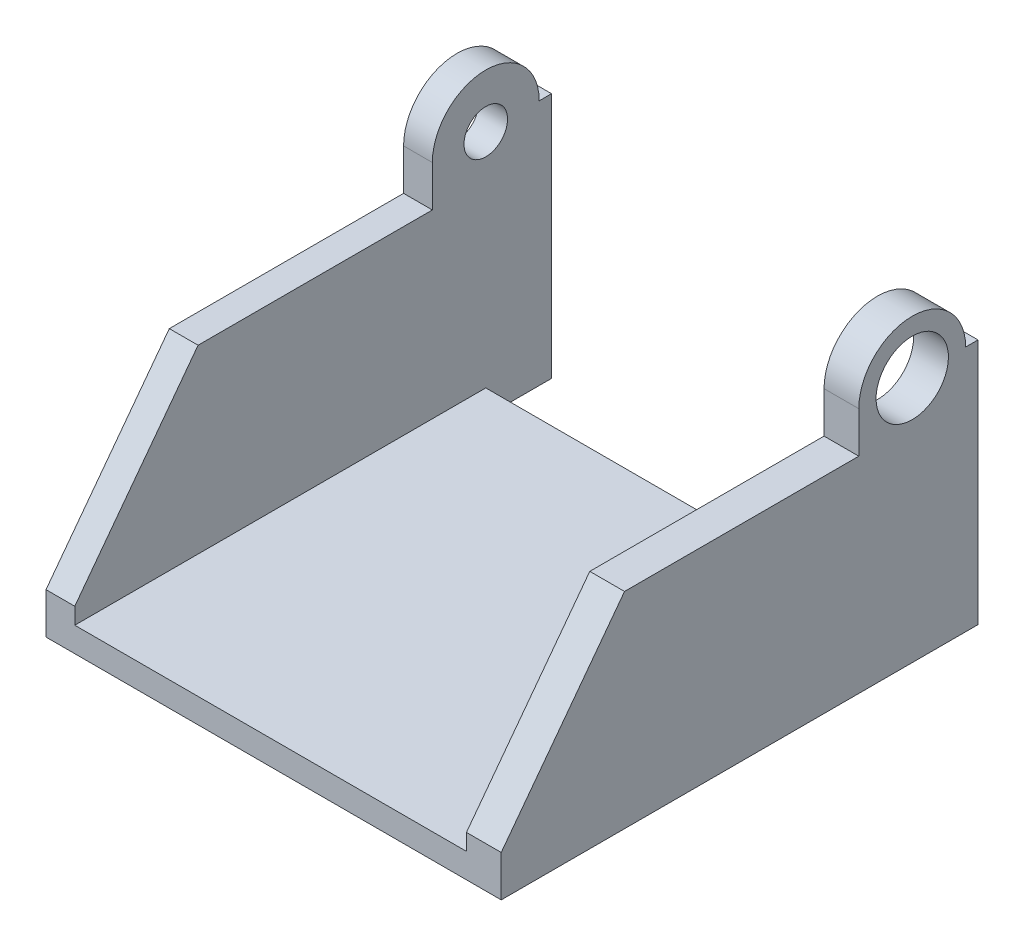
ISO-10303-21;
HEADER;
FILE_DESCRIPTION(('STEP AP214'),'2;1');
FILE_NAME('part.step','',(''),(''),'','','');
FILE_SCHEMA(('AUTOMOTIVE_DESIGN { 1 0 10303 214 1 1 1 1 }'));
ENDSEC;
DATA;
#1=APPLICATION_CONTEXT('core data for automotive mechanical design processes');
#2=APPLICATION_PROTOCOL_DEFINITION('international standard','automotive_design',2000,#1);
#3=PRODUCT_CONTEXT('',#1,'mechanical');
#4=PRODUCT('Part','Part','',(#3));
#5=PRODUCT_RELATED_PRODUCT_CATEGORY('part','',(#4));
#6=PRODUCT_DEFINITION_FORMATION('','',#4);
#7=PRODUCT_DEFINITION_CONTEXT('part definition',#1,'design');
#8=PRODUCT_DEFINITION('design','',#6,#7);
#9=PRODUCT_DEFINITION_SHAPE('','',#8);
#10=(LENGTH_UNIT() NAMED_UNIT(*) SI_UNIT(.MILLI.,.METRE.));
#11=(NAMED_UNIT(*) PLANE_ANGLE_UNIT() SI_UNIT($,.RADIAN.));
#12=(NAMED_UNIT(*) SI_UNIT($,.STERADIAN.) SOLID_ANGLE_UNIT());
#13=UNCERTAINTY_MEASURE_WITH_UNIT(LENGTH_MEASURE(1.E-05),#10,'distance_accuracy_value','');
#14=(GEOMETRIC_REPRESENTATION_CONTEXT(3) GLOBAL_UNCERTAINTY_ASSIGNED_CONTEXT((#13)) GLOBAL_UNIT_ASSIGNED_CONTEXT((#10,
#11,#12)) REPRESENTATION_CONTEXT('',''));
#15=CARTESIAN_POINT('',(0.,0.,0.));
#16=DIRECTION('',(0.,0.,1.));
#17=DIRECTION('',(1.,0.,0.));
#18=AXIS2_PLACEMENT_3D('',#15,#16,#17);
#19=CARTESIAN_POINT('',(0.,0.,50.));
#20=DIRECTION('',(0.,0.,1.));
#21=DIRECTION('',(1.,0.,0.));
#22=AXIS2_PLACEMENT_3D('',#19,#20,#21);
#23=PLANE('',#22);
#24=DIRECTION('',(-1.,0.,0.));
#25=VECTOR('',#24,1.);
#26=CARTESIAN_POINT('',(0.,-30.,50.));
#27=LINE('',#26,#25);
#28=CARTESIAN_POINT('',(28.055,-30.,50.));
#29=VERTEX_POINT('',#28);
#30=CARTESIAN_POINT('',(-27.325,-30.,50.));
#31=VERTEX_POINT('',#30);
#32=EDGE_CURVE('E347',#29,#31,#27,.T.);
#33=ORIENTED_EDGE('',*,*,#32,.F.);
#34=DIRECTION('',(0.,-1.,0.));
#35=VECTOR('',#34,1.);
#36=CARTESIAN_POINT('',(28.055,-25.,50.));
#37=LINE('',#36,#35);
#38=CARTESIAN_POINT('',(28.055,-25.,50.));
#39=VERTEX_POINT('',#38);
#40=EDGE_CURVE('E226',#39,#29,#37,.T.);
#41=ORIENTED_EDGE('',*,*,#40,.F.);
#42=DIRECTION('',(-1.,0.,0.));
#43=VECTOR('',#42,1.);
#44=CARTESIAN_POINT('',(0.,-25.,50.));
#45=LINE('',#44,#43);
#46=CARTESIAN_POINT('',(23.825,-25.,50.));
#47=VERTEX_POINT('',#46);
#48=EDGE_CURVE('E11',#39,#47,#45,.T.);
#49=ORIENTED_EDGE('',*,*,#48,.T.);
#50=DIRECTION('',(0.,-1.,0.));
#51=VECTOR('',#50,1.);
#52=CARTESIAN_POINT('',(23.825,0.,50.));
#53=LINE('',#52,#51);
#54=CARTESIAN_POINT('',(23.825,-27.,50.));
#55=VERTEX_POINT('',#54);
#56=EDGE_CURVE('E285',#47,#55,#53,.T.);
#57=ORIENTED_EDGE('',*,*,#56,.T.);
#58=DIRECTION('',(1.,0.,0.));
#59=VECTOR('',#58,1.);
#60=CARTESIAN_POINT('',(0.,-27.,50.));
#61=LINE('',#60,#59);
#62=CARTESIAN_POINT('',(-23.825,-27.,50.));
#63=VERTEX_POINT('',#62);
#64=EDGE_CURVE('E351',#63,#55,#61,.T.);
#65=ORIENTED_EDGE('',*,*,#64,.F.);
#66=DIRECTION('',(0.,-1.,0.));
#67=VECTOR('',#66,1.);
#68=CARTESIAN_POINT('',(-23.825,0.,50.));
#69=LINE('',#68,#67);
#70=CARTESIAN_POINT('',(-23.825,-25.,50.));
#71=VERTEX_POINT('',#70);
#72=EDGE_CURVE('E355',#71,#63,#69,.T.);
#73=ORIENTED_EDGE('',*,*,#72,.F.);
#74=DIRECTION('',(1.,0.,0.));
#75=VECTOR('',#74,1.);
#76=CARTESIAN_POINT('',(0.,-25.,50.));
#77=LINE('',#76,#75);
#78=CARTESIAN_POINT('',(-27.325,-25.,50.));
#79=VERTEX_POINT('',#78);
#80=EDGE_CURVE('E369',#79,#71,#77,.T.);
#81=ORIENTED_EDGE('',*,*,#80,.F.);
#82=DIRECTION('',(0.,-1.,0.));
#83=VECTOR('',#82,1.);
#84=CARTESIAN_POINT('',(-27.325,0.,50.));
#85=LINE('',#84,#83);
#86=EDGE_CURVE('E343',#79,#31,#85,.T.);
#87=ORIENTED_EDGE('',*,*,#86,.T.);
#88=EDGE_LOOP('',(#33,#41,#49,#57,#65,#73,#81,#87));
#89=FACE_BOUND('',#88,.T.);
#90=ADVANCED_FACE('F47',(#89),#23,.T.);
#91=CARTESIAN_POINT('',(0.,-30.,50.));
#92=DIRECTION('',(0.,-1.,0.));
#93=DIRECTION('',(0.,0.,-1.));
#94=AXIS2_PLACEMENT_3D('',#91,#92,#93);
#95=PLANE('',#94);
#96=DIRECTION('',(-1.,0.,0.));
#97=VECTOR('',#96,1.);
#98=CARTESIAN_POINT('',(27.325,-30.,-8.));
#99=LINE('',#98,#97);
#100=CARTESIAN_POINT('',(28.055,-30.,-8.));
#101=VERTEX_POINT('',#100);
#102=CARTESIAN_POINT('',(23.825,-30.,-8.));
#103=VERTEX_POINT('',#102);
#104=EDGE_CURVE('E185',#101,#103,#99,.T.);
#105=ORIENTED_EDGE('',*,*,#104,.F.);
#106=DIRECTION('',(0.,0.,-1.));
#107=VECTOR('',#106,1.);
#108=CARTESIAN_POINT('',(28.055,-30.,50.));
#109=LINE('',#108,#107);
#110=EDGE_CURVE('E203',#29,#101,#109,.T.);
#111=ORIENTED_EDGE('',*,*,#110,.F.);
#112=ORIENTED_EDGE('',*,*,#32,.T.);
#113=DIRECTION('',(0.,0.,-1.));
#114=VECTOR('',#113,1.);
#115=CARTESIAN_POINT('',(-27.325,-30.,50.));
#116=LINE('',#115,#114);
#117=CARTESIAN_POINT('',(-27.325,-30.,-8.));
#118=VERTEX_POINT('',#117);
#119=EDGE_CURVE('E366',#31,#118,#116,.T.);
#120=ORIENTED_EDGE('',*,*,#119,.T.);
#121=DIRECTION('',(1.,0.,0.));
#122=VECTOR('',#121,1.);
#123=CARTESIAN_POINT('',(-27.325,-30.,-8.));
#124=LINE('',#123,#122);
#125=CARTESIAN_POINT('',(-23.825,-30.,-8.));
#126=VERTEX_POINT('',#125);
#127=EDGE_CURVE('E335',#118,#126,#124,.T.);
#128=ORIENTED_EDGE('',*,*,#127,.T.);
#129=DIRECTION('',(0.,0.,-1.));
#130=VECTOR('',#129,1.);
#131=CARTESIAN_POINT('',(-23.825,-30.,0.));
#132=LINE('',#131,#130);
#133=CARTESIAN_POINT('',(-23.825,-30.,0.));
#134=VERTEX_POINT('',#133);
#135=EDGE_CURVE('E323',#134,#126,#132,.T.);
#136=ORIENTED_EDGE('',*,*,#135,.F.);
#137=DIRECTION('',(-1.,0.,0.));
#138=VECTOR('',#137,1.);
#139=CARTESIAN_POINT('',(0.,-30.,0.));
#140=LINE('',#139,#138);
#141=CARTESIAN_POINT('',(23.825,-30.,0.));
#142=VERTEX_POINT('',#141);
#143=EDGE_CURVE('E334',#142,#134,#140,.T.);
#144=ORIENTED_EDGE('',*,*,#143,.F.);
#145=DIRECTION('',(0.,0.,-1.));
#146=VECTOR('',#145,1.);
#147=CARTESIAN_POINT('',(23.825,-30.,0.));
#148=LINE('',#147,#146);
#149=EDGE_CURVE('E274',#142,#103,#148,.T.);
#150=ORIENTED_EDGE('',*,*,#149,.T.);
#151=EDGE_LOOP('',(#105,#111,#112,#120,#128,#136,#144,#150));
#152=FACE_BOUND('',#151,.T.);
#153=ADVANCED_FACE('F407',(#152),#95,.T.);
#154=CARTESIAN_POINT('',(27.325,0.,0.));
#155=DIRECTION('',(0.,1.,0.));
#156=DIRECTION('',(0.,0.,1.));
#157=AXIS2_PLACEMENT_3D('',#154,#155,#156);
#158=PLANE('',#157);
#159=DIRECTION('',(-1.,0.,0.));
#160=VECTOR('',#159,1.);
#161=CARTESIAN_POINT('',(27.325,0.,-6.5));
#162=LINE('',#161,#160);
#163=CARTESIAN_POINT('',(28.055,0.,-6.5));
#164=VERTEX_POINT('',#163);
#165=CARTESIAN_POINT('',(23.825,0.,-6.5));
#166=VERTEX_POINT('',#165);
#167=EDGE_CURVE('E191',#164,#166,#162,.T.);
#168=ORIENTED_EDGE('',*,*,#167,.F.);
#169=DIRECTION('',(0.,0.,1.));
#170=VECTOR('',#169,1.);
#171=CARTESIAN_POINT('',(28.055,0.,-8.));
#172=LINE('',#171,#170);
#173=CARTESIAN_POINT('',(28.055,0.,-8.));
#174=VERTEX_POINT('',#173);
#175=EDGE_CURVE('E189',#174,#164,#172,.T.);
#176=ORIENTED_EDGE('',*,*,#175,.F.);
#177=DIRECTION('',(-1.,0.,0.));
#178=VECTOR('',#177,1.);
#179=CARTESIAN_POINT('',(27.325,0.,-8.));
#180=LINE('',#179,#178);
#181=CARTESIAN_POINT('',(23.825,0.,-8.));
#182=VERTEX_POINT('',#181);
#183=EDGE_CURVE('E174',#174,#182,#180,.T.);
#184=ORIENTED_EDGE('',*,*,#183,.T.);
#185=DIRECTION('',(0.,0.,-1.));
#186=VECTOR('',#185,1.);
#187=CARTESIAN_POINT('',(23.825,0.,0.));
#188=LINE('',#187,#186);
#189=EDGE_CURVE('E269',#166,#182,#188,.T.);
#190=ORIENTED_EDGE('',*,*,#189,.F.);
#191=EDGE_LOOP('',(#168,#176,#184,#190));
#192=FACE_BOUND('',#191,.T.);
#193=ADVANCED_FACE('F190',(#192),#158,.T.);
#194=CARTESIAN_POINT('',(27.325,0.,0.));
#195=DIRECTION('',(-1.,0.,0.));
#196=DIRECTION('',(0.,-1.,0.));
#197=AXIS2_PLACEMENT_3D('',#194,#195,#196);
#198=CYLINDRICAL_SURFACE('',#197,6.5);
#199=DIRECTION('',(-1.,0.,0.));
#200=VECTOR('',#199,1.);
#201=CARTESIAN_POINT('',(27.325,0.,6.5));
#202=LINE('',#201,#200);
#203=CARTESIAN_POINT('',(28.055,0.,6.5));
#204=VERTEX_POINT('',#203);
#205=CARTESIAN_POINT('',(23.825,0.,6.5));
#206=VERTEX_POINT('',#205);
#207=EDGE_CURVE('E286',#204,#206,#202,.T.);
#208=ORIENTED_EDGE('',*,*,#207,.F.);
#209=CARTESIAN_POINT('',(28.055,0.,0.));
#210=DIRECTION('',(1.,0.,0.));
#211=DIRECTION('',(0.,1.,0.));
#212=AXIS2_PLACEMENT_3D('',#209,#210,#211);
#213=CIRCLE('',#212,6.5);
#214=EDGE_CURVE('E196',#164,#204,#213,.T.);
#215=ORIENTED_EDGE('',*,*,#214,.F.);
#216=ORIENTED_EDGE('',*,*,#167,.T.);
#217=CARTESIAN_POINT('',(23.825,0.,0.));
#218=DIRECTION('',(1.,0.,0.));
#219=DIRECTION('',(0.,1.,0.));
#220=AXIS2_PLACEMENT_3D('',#217,#218,#219);
#221=CIRCLE('',#220,6.5);
#222=EDGE_CURVE('E186',#166,#206,#221,.T.);
#223=ORIENTED_EDGE('',*,*,#222,.T.);
#224=EDGE_LOOP('',(#208,#215,#216,#223));
#225=FACE_BOUND('',#224,.T.);
#226=ADVANCED_FACE('F489',(#225),#198,.T.);
#227=CARTESIAN_POINT('',(27.325,0.,-8.));
#228=DIRECTION('',(0.,0.,-1.));
#229=DIRECTION('',(0.,1.,0.));
#230=AXIS2_PLACEMENT_3D('',#227,#228,#229);
#231=PLANE('',#230);
#232=ORIENTED_EDGE('',*,*,#183,.F.);
#233=DIRECTION('',(0.,1.,0.));
#234=VECTOR('',#233,1.);
#235=CARTESIAN_POINT('',(28.055,-30.,-8.));
#236=LINE('',#235,#234);
#237=EDGE_CURVE('E178',#101,#174,#236,.T.);
#238=ORIENTED_EDGE('',*,*,#237,.F.);
#239=ORIENTED_EDGE('',*,*,#104,.T.);
#240=DIRECTION('',(0.,-1.,0.));
#241=VECTOR('',#240,1.);
#242=CARTESIAN_POINT('',(23.825,0.,-8.));
#243=LINE('',#242,#241);
#244=EDGE_CURVE('E180',#182,#103,#243,.T.);
#245=ORIENTED_EDGE('',*,*,#244,.F.);
#246=EDGE_LOOP('',(#232,#238,#239,#245));
#247=FACE_BOUND('',#246,.T.);
#248=ADVANCED_FACE('F176',(#247),#231,.T.);
#249=CARTESIAN_POINT('',(20.175,-5.,0.));
#250=DIRECTION('',(0.,1.,0.));
#251=DIRECTION('',(-1.,0.,0.));
#252=AXIS2_PLACEMENT_3D('',#249,#250,#251);
#253=PLANE('',#252);
#254=DIRECTION('',(1.,0.,0.));
#255=VECTOR('',#254,1.);
#256=CARTESIAN_POINT('',(20.175,-5.,35.));
#257=LINE('',#256,#255);
#258=CARTESIAN_POINT('',(23.825,-5.,35.));
#259=VERTEX_POINT('',#258);
#260=CARTESIAN_POINT('',(28.055,-5.,35.));
#261=VERTEX_POINT('',#260);
#262=EDGE_CURVE('E231',#259,#261,#257,.T.);
#263=ORIENTED_EDGE('',*,*,#262,.T.);
#264=DIRECTION('',(0.,0.,1.));
#265=VECTOR('',#264,1.);
#266=CARTESIAN_POINT('',(28.055,-5.,6.5));
#267=LINE('',#266,#265);
#268=CARTESIAN_POINT('',(28.055,-5.,6.5));
#269=VERTEX_POINT('',#268);
#270=EDGE_CURVE('E218',#269,#261,#267,.T.);
#271=ORIENTED_EDGE('',*,*,#270,.F.);
#272=DIRECTION('',(1.,0.,0.));
#273=VECTOR('',#272,1.);
#274=CARTESIAN_POINT('',(20.175,-5.,6.5));
#275=LINE('',#274,#273);
#276=CARTESIAN_POINT('',(23.825,-5.,6.5));
#277=VERTEX_POINT('',#276);
#278=EDGE_CURVE('E232',#277,#269,#275,.T.);
#279=ORIENTED_EDGE('',*,*,#278,.F.);
#280=DIRECTION('',(0.,0.,1.));
#281=VECTOR('',#280,1.);
#282=CARTESIAN_POINT('',(23.825,-5.,50.));
#283=LINE('',#282,#281);
#284=EDGE_CURVE('E244',#277,#259,#283,.T.);
#285=ORIENTED_EDGE('',*,*,#284,.T.);
#286=EDGE_LOOP('',(#263,#271,#279,#285));
#287=FACE_BOUND('',#286,.T.);
#288=ADVANCED_FACE('F473',(#287),#253,.T.);
#289=CARTESIAN_POINT('',(20.175,15.,20.));
#290=DIRECTION('',(0.,0.6,0.8));
#291=DIRECTION('',(0.,-0.8,0.6));
#292=AXIS2_PLACEMENT_3D('',#289,#290,#291);
#293=PLANE('',#292);
#294=ORIENTED_EDGE('',*,*,#48,.F.);
#295=DIRECTION('',(0.,-0.8,0.6));
#296=VECTOR('',#295,1.);
#297=CARTESIAN_POINT('',(28.055,-5.,35.));
#298=LINE('',#297,#296);
#299=EDGE_CURVE('E222',#261,#39,#298,.T.);
#300=ORIENTED_EDGE('',*,*,#299,.F.);
#301=ORIENTED_EDGE('',*,*,#262,.F.);
#302=DIRECTION('',(0.,-0.8,0.6));
#303=VECTOR('',#302,1.);
#304=CARTESIAN_POINT('',(23.825,-9.00000000000001,38.));
#305=LINE('',#304,#303);
#306=EDGE_CURVE('E240',#259,#47,#305,.T.);
#307=ORIENTED_EDGE('',*,*,#306,.T.);
#308=EDGE_LOOP('',(#294,#300,#301,#307));
#309=FACE_BOUND('',#308,.T.);
#310=ADVANCED_FACE('F476',(#309),#293,.T.);
#311=CARTESIAN_POINT('',(20.175,0.,6.5));
#312=DIRECTION('',(0.,0.,1.));
#313=DIRECTION('',(0.,-1.,0.));
#314=AXIS2_PLACEMENT_3D('',#311,#312,#313);
#315=PLANE('',#314);
#316=ORIENTED_EDGE('',*,*,#278,.T.);
#317=DIRECTION('',(0.,-1.,0.));
#318=VECTOR('',#317,1.);
#319=CARTESIAN_POINT('',(28.055,0.,6.5));
#320=LINE('',#319,#318);
#321=EDGE_CURVE('E214',#204,#269,#320,.T.);
#322=ORIENTED_EDGE('',*,*,#321,.F.);
#323=ORIENTED_EDGE('',*,*,#207,.T.);
#324=DIRECTION('',(0.,-1.,0.));
#325=VECTOR('',#324,1.);
#326=CARTESIAN_POINT('',(23.825,0.,6.5));
#327=LINE('',#326,#325);
#328=EDGE_CURVE('E235',#206,#277,#327,.T.);
#329=ORIENTED_EDGE('',*,*,#328,.T.);
#330=EDGE_LOOP('',(#316,#322,#323,#329));
#331=FACE_BOUND('',#330,.T.);
#332=ADVANCED_FACE('F444',(#331),#315,.T.);
#333=CARTESIAN_POINT('',(23.825,0.,50.));
#334=DIRECTION('',(1.,0.,0.));
#335=DIRECTION('',(0.,1.,0.));
#336=AXIS2_PLACEMENT_3D('',#333,#334,#335);
#337=PLANE('',#336);
#338=CARTESIAN_POINT('',(23.825,0.,0.));
#339=DIRECTION('',(1.,0.,0.));
#340=DIRECTION('',(0.,1.,0.));
#341=AXIS2_PLACEMENT_3D('',#338,#339,#340);
#342=CIRCLE('',#341,4.4);
#343=CARTESIAN_POINT('',(23.825,4.4,0.));
#344=VERTEX_POINT('',#343);
#345=EDGE_CURVE('E452',#344,#344,#342,.T.);
#346=ORIENTED_EDGE('',*,*,#345,.T.);
#347=EDGE_LOOP('',(#346));
#348=FACE_BOUND('',#347,.T.);
#349=ORIENTED_EDGE('',*,*,#328,.F.);
#350=ORIENTED_EDGE('',*,*,#222,.F.);
#351=ORIENTED_EDGE('',*,*,#189,.T.);
#352=ORIENTED_EDGE('',*,*,#244,.T.);
#353=ORIENTED_EDGE('',*,*,#149,.F.);
#354=DIRECTION('',(0.,1.,0.));
#355=VECTOR('',#354,1.);
#356=CARTESIAN_POINT('',(23.825,0.,0.));
#357=LINE('',#356,#355);
#358=CARTESIAN_POINT('',(23.825,-27.,0.));
#359=VERTEX_POINT('',#358);
#360=EDGE_CURVE('E64',#142,#359,#357,.T.);
#361=ORIENTED_EDGE('',*,*,#360,.T.);
#362=DIRECTION('',(0.,0.,-1.));
#363=VECTOR('',#362,1.);
#364=CARTESIAN_POINT('',(23.825,-27.,50.));
#365=LINE('',#364,#363);
#366=EDGE_CURVE('E293',#55,#359,#365,.T.);
#367=ORIENTED_EDGE('',*,*,#366,.F.);
#368=ORIENTED_EDGE('',*,*,#56,.F.);
#369=ORIENTED_EDGE('',*,*,#306,.F.);
#370=ORIENTED_EDGE('',*,*,#284,.F.);
#371=EDGE_LOOP('',(#349,#350,#351,#352,#353,#361,#367,#368,#369,#370));
#372=FACE_BOUND('',#371,.T.);
#373=ADVANCED_FACE('F438',(#348,#372),#337,.F.);
#374=CARTESIAN_POINT('',(-27.325,0.,50.));
#375=DIRECTION('',(1.,0.,0.));
#376=DIRECTION('',(0.,1.,0.));
#377=AXIS2_PLACEMENT_3D('',#374,#375,#376);
#378=PLANE('',#377);
#379=CARTESIAN_POINT('',(-27.325,0.,0.));
#380=DIRECTION('',(-1.,0.,0.));
#381=DIRECTION('',(0.,-1.,0.));
#382=AXIS2_PLACEMENT_3D('',#379,#380,#381);
#383=CIRCLE('',#382,2.65);
#384=CARTESIAN_POINT('',(-27.325,-2.65,0.));
#385=VERTEX_POINT('',#384);
#386=EDGE_CURVE('E449',#385,#385,#383,.T.);
#387=ORIENTED_EDGE('',*,*,#386,.F.);
#388=EDGE_LOOP('',(#387));
#389=FACE_BOUND('',#388,.T.);
#390=DIRECTION('',(0.,0.,1.));
#391=VECTOR('',#390,1.);
#392=CARTESIAN_POINT('',(-27.325,-5.,0.));
#393=LINE('',#392,#391);
#394=CARTESIAN_POINT('',(-27.325,-5.,6.5));
#395=VERTEX_POINT('',#394);
#396=CARTESIAN_POINT('',(-27.325,-5.,35.));
#397=VERTEX_POINT('',#396);
#398=EDGE_CURVE('E251',#395,#397,#393,.T.);
#399=ORIENTED_EDGE('',*,*,#398,.F.);
#400=DIRECTION('',(0.,-1.,0.));
#401=VECTOR('',#400,1.);
#402=CARTESIAN_POINT('',(-27.325,0.,6.5));
#403=LINE('',#402,#401);
#404=CARTESIAN_POINT('',(-27.325,0.,6.5));
#405=VERTEX_POINT('',#404);
#406=EDGE_CURVE('E247',#405,#395,#403,.T.);
#407=ORIENTED_EDGE('',*,*,#406,.F.);
#408=CARTESIAN_POINT('',(-27.325,0.,0.));
#409=DIRECTION('',(1.,0.,0.));
#410=DIRECTION('',(0.,1.,0.));
#411=AXIS2_PLACEMENT_3D('',#408,#409,#410);
#412=CIRCLE('',#411,6.5);
#413=CARTESIAN_POINT('',(-27.325,0.,-6.5));
#414=VERTEX_POINT('',#413);
#415=EDGE_CURVE('E302',#414,#405,#412,.T.);
#416=ORIENTED_EDGE('',*,*,#415,.F.);
#417=DIRECTION('',(0.,0.,-1.));
#418=VECTOR('',#417,1.);
#419=CARTESIAN_POINT('',(-27.325,0.,0.));
#420=LINE('',#419,#418);
#421=CARTESIAN_POINT('',(-27.325,0.,-8.));
#422=VERTEX_POINT('',#421);
#423=EDGE_CURVE('E298',#414,#422,#420,.T.);
#424=ORIENTED_EDGE('',*,*,#423,.T.);
#425=DIRECTION('',(0.,-1.,0.));
#426=VECTOR('',#425,1.);
#427=CARTESIAN_POINT('',(-27.325,0.,-8.));
#428=LINE('',#427,#426);
#429=EDGE_CURVE('E307',#422,#118,#428,.T.);
#430=ORIENTED_EDGE('',*,*,#429,.T.);
#431=ORIENTED_EDGE('',*,*,#119,.F.);
#432=ORIENTED_EDGE('',*,*,#86,.F.);
#433=DIRECTION('',(0.,-0.8,0.6));
#434=VECTOR('',#433,1.);
#435=CARTESIAN_POINT('',(-27.325,15.,20.));
#436=LINE('',#435,#434);
#437=EDGE_CURVE('E255',#397,#79,#436,.T.);
#438=ORIENTED_EDGE('',*,*,#437,.F.);
#439=EDGE_LOOP('',(#399,#407,#416,#424,#430,#431,#432,#438));
#440=FACE_BOUND('',#439,.T.);
#441=ADVANCED_FACE('F49',(#389,#440),#378,.F.);
#442=CARTESIAN_POINT('',(0.,-27.,50.));
#443=DIRECTION('',(0.,1.,0.));
#444=DIRECTION('',(0.,0.,1.));
#445=AXIS2_PLACEMENT_3D('',#442,#443,#444);
#446=PLANE('',#445);
#447=DIRECTION('',(1.,0.,0.));
#448=VECTOR('',#447,1.);
#449=CARTESIAN_POINT('',(0.,-27.,0.));
#450=LINE('',#449,#448);
#451=CARTESIAN_POINT('',(-23.825,-27.,0.));
#452=VERTEX_POINT('',#451);
#453=EDGE_CURVE('E348',#452,#359,#450,.T.);
#454=ORIENTED_EDGE('',*,*,#453,.F.);
#455=DIRECTION('',(0.,0.,-1.));
#456=VECTOR('',#455,1.);
#457=CARTESIAN_POINT('',(-23.825,-27.,50.));
#458=LINE('',#457,#456);
#459=EDGE_CURVE('E358',#63,#452,#458,.T.);
#460=ORIENTED_EDGE('',*,*,#459,.F.);
#461=ORIENTED_EDGE('',*,*,#64,.T.);
#462=ORIENTED_EDGE('',*,*,#366,.T.);
#463=EDGE_LOOP('',(#454,#460,#461,#462));
#464=FACE_BOUND('',#463,.T.);
#465=ADVANCED_FACE('F402',(#464),#446,.T.);
#466=CARTESIAN_POINT('',(-23.825,0.,50.));
#467=DIRECTION('',(1.,0.,0.));
#468=DIRECTION('',(0.,1.,0.));
#469=AXIS2_PLACEMENT_3D('',#466,#467,#468);
#470=PLANE('',#469);
#471=CARTESIAN_POINT('',(-23.825,0.,0.));
#472=DIRECTION('',(1.,0.,0.));
#473=DIRECTION('',(0.,1.,0.));
#474=AXIS2_PLACEMENT_3D('',#471,#472,#473);
#475=CIRCLE('',#474,2.65);
#476=CARTESIAN_POINT('',(-23.825,2.65,0.));
#477=VERTEX_POINT('',#476);
#478=EDGE_CURVE('E51',#477,#477,#475,.T.);
#479=ORIENTED_EDGE('',*,*,#478,.F.);
#480=EDGE_LOOP('',(#479));
#481=FACE_BOUND('',#480,.T.);
#482=DIRECTION('',(0.,1.,0.));
#483=VECTOR('',#482,1.);
#484=CARTESIAN_POINT('',(-23.825,0.,6.5));
#485=LINE('',#484,#483);
#486=CARTESIAN_POINT('',(-23.825,-5.,6.5));
#487=VERTEX_POINT('',#486);
#488=CARTESIAN_POINT('',(-23.825,0.,6.5));
#489=VERTEX_POINT('',#488);
#490=EDGE_CURVE('E72',#487,#489,#485,.T.);
#491=ORIENTED_EDGE('',*,*,#490,.F.);
#492=DIRECTION('',(0.,0.,-1.));
#493=VECTOR('',#492,1.);
#494=CARTESIAN_POINT('',(-23.825,-5.,50.));
#495=LINE('',#494,#493);
#496=CARTESIAN_POINT('',(-23.825,-5.,35.));
#497=VERTEX_POINT('',#496);
#498=EDGE_CURVE('E57',#497,#487,#495,.T.);
#499=ORIENTED_EDGE('',*,*,#498,.F.);
#500=DIRECTION('',(0.,0.8,-0.6));
#501=VECTOR('',#500,1.);
#502=CARTESIAN_POINT('',(-23.825,-9.00000000000001,38.));
#503=LINE('',#502,#501);
#504=EDGE_CURVE('E266',#71,#497,#503,.T.);
#505=ORIENTED_EDGE('',*,*,#504,.F.);
#506=ORIENTED_EDGE('',*,*,#72,.T.);
#507=ORIENTED_EDGE('',*,*,#459,.T.);
#508=DIRECTION('',(0.,1.,0.));
#509=VECTOR('',#508,1.);
#510=CARTESIAN_POINT('',(-23.825,0.,0.));
#511=LINE('',#510,#509);
#512=EDGE_CURVE('E319',#134,#452,#511,.T.);
#513=ORIENTED_EDGE('',*,*,#512,.F.);
#514=ORIENTED_EDGE('',*,*,#135,.T.);
#515=DIRECTION('',(0.,-1.,0.));
#516=VECTOR('',#515,1.);
#517=CARTESIAN_POINT('',(-23.825,0.,-8.));
#518=LINE('',#517,#516);
#519=CARTESIAN_POINT('',(-23.825,0.,-8.));
#520=VERTEX_POINT('',#519);
#521=EDGE_CURVE('E303',#520,#126,#518,.T.);
#522=ORIENTED_EDGE('',*,*,#521,.F.);
#523=DIRECTION('',(0.,0.,-1.));
#524=VECTOR('',#523,1.);
#525=CARTESIAN_POINT('',(-23.825,0.,0.));
#526=LINE('',#525,#524);
#527=CARTESIAN_POINT('',(-23.825,0.,-6.5));
#528=VERTEX_POINT('',#527);
#529=EDGE_CURVE('E297',#528,#520,#526,.T.);
#530=ORIENTED_EDGE('',*,*,#529,.F.);
#531=CARTESIAN_POINT('',(-23.825,0.,0.));
#532=DIRECTION('',(1.,0.,0.));
#533=DIRECTION('',(0.,1.,0.));
#534=AXIS2_PLACEMENT_3D('',#531,#532,#533);
#535=CIRCLE('',#534,6.5);
#536=EDGE_CURVE('E315',#528,#489,#535,.T.);
#537=ORIENTED_EDGE('',*,*,#536,.T.);
#538=EDGE_LOOP('',(#491,#499,#505,#506,#507,#513,#514,#522,#530,#537));
#539=FACE_BOUND('',#538,.T.);
#540=ADVANCED_FACE('F382',(#481,#539),#470,.T.);
#541=CARTESIAN_POINT('',(0.,0.,0.));
#542=DIRECTION('',(0.,0.,1.));
#543=DIRECTION('',(1.,0.,0.));
#544=AXIS2_PLACEMENT_3D('',#541,#542,#543);
#545=PLANE('',#544);
#546=ORIENTED_EDGE('',*,*,#453,.T.);
#547=ORIENTED_EDGE('',*,*,#360,.F.);
#548=ORIENTED_EDGE('',*,*,#143,.T.);
#549=ORIENTED_EDGE('',*,*,#512,.T.);
#550=EDGE_LOOP('',(#546,#547,#548,#549));
#551=FACE_BOUND('',#550,.T.);
#552=ADVANCED_FACE('F404',(#551),#545,.F.);
#553=CARTESIAN_POINT('',(-27.325,0.,0.));
#554=DIRECTION('',(0.,-1.,0.));
#555=DIRECTION('',(0.,0.,-1.));
#556=AXIS2_PLACEMENT_3D('',#553,#554,#555);
#557=PLANE('',#556);
#558=ORIENTED_EDGE('',*,*,#529,.T.);
#559=DIRECTION('',(1.,0.,0.));
#560=VECTOR('',#559,1.);
#561=CARTESIAN_POINT('',(-27.325,0.,-8.));
#562=LINE('',#561,#560);
#563=EDGE_CURVE('E330',#422,#520,#562,.T.);
#564=ORIENTED_EDGE('',*,*,#563,.F.);
#565=ORIENTED_EDGE('',*,*,#423,.F.);
#566=DIRECTION('',(1.,0.,0.));
#567=VECTOR('',#566,1.);
#568=CARTESIAN_POINT('',(-27.325,0.,-6.5));
#569=LINE('',#568,#567);
#570=EDGE_CURVE('E311',#414,#528,#569,.T.);
#571=ORIENTED_EDGE('',*,*,#570,.T.);
#572=EDGE_LOOP('',(#558,#564,#565,#571));
#573=FACE_BOUND('',#572,.T.);
#574=ADVANCED_FACE('F414',(#573),#557,.F.);
#575=CARTESIAN_POINT('',(-27.325,0.,-8.));
#576=DIRECTION('',(0.,0.,1.));
#577=DIRECTION('',(0.,-1.,0.));
#578=AXIS2_PLACEMENT_3D('',#575,#576,#577);
#579=PLANE('',#578);
#580=ORIENTED_EDGE('',*,*,#521,.T.);
#581=ORIENTED_EDGE('',*,*,#127,.F.);
#582=ORIENTED_EDGE('',*,*,#429,.F.);
#583=ORIENTED_EDGE('',*,*,#563,.T.);
#584=EDGE_LOOP('',(#580,#581,#582,#583));
#585=FACE_BOUND('',#584,.T.);
#586=ADVANCED_FACE('F411',(#585),#579,.F.);
#587=CARTESIAN_POINT('',(-27.325,0.,0.));
#588=DIRECTION('',(1.,0.,0.));
#589=DIRECTION('',(0.,1.,0.));
#590=AXIS2_PLACEMENT_3D('',#587,#588,#589);
#591=CYLINDRICAL_SURFACE('',#590,6.5);
#592=ORIENTED_EDGE('',*,*,#536,.F.);
#593=ORIENTED_EDGE('',*,*,#570,.F.);
#594=ORIENTED_EDGE('',*,*,#415,.T.);
#595=DIRECTION('',(1.,0.,0.));
#596=VECTOR('',#595,1.);
#597=CARTESIAN_POINT('',(-27.325,0.,6.5));
#598=LINE('',#597,#596);
#599=EDGE_CURVE('E338',#405,#489,#598,.T.);
#600=ORIENTED_EDGE('',*,*,#599,.T.);
#601=EDGE_LOOP('',(#592,#593,#594,#600));
#602=FACE_BOUND('',#601,.T.);
#603=ADVANCED_FACE('F386',(#602),#591,.T.);
#604=CARTESIAN_POINT('',(-20.175,0.,6.5));
#605=DIRECTION('',(0.,0.,-1.));
#606=DIRECTION('',(0.,1.,0.));
#607=AXIS2_PLACEMENT_3D('',#604,#605,#606);
#608=PLANE('',#607);
#609=ORIENTED_EDGE('',*,*,#490,.T.);
#610=ORIENTED_EDGE('',*,*,#599,.F.);
#611=ORIENTED_EDGE('',*,*,#406,.T.);
#612=DIRECTION('',(-1.,0.,0.));
#613=VECTOR('',#612,1.);
#614=CARTESIAN_POINT('',(-20.175,-5.,6.5));
#615=LINE('',#614,#613);
#616=EDGE_CURVE('E258',#487,#395,#615,.T.);
#617=ORIENTED_EDGE('',*,*,#616,.F.);
#618=EDGE_LOOP('',(#609,#610,#611,#617));
#619=FACE_BOUND('',#618,.T.);
#620=ADVANCED_FACE('F379',(#619),#608,.F.);
#621=CARTESIAN_POINT('',(-20.175,15.,20.));
#622=DIRECTION('',(0.,-0.6,-0.8));
#623=DIRECTION('',(0.,0.8,-0.6));
#624=AXIS2_PLACEMENT_3D('',#621,#622,#623);
#625=PLANE('',#624);
#626=ORIENTED_EDGE('',*,*,#504,.T.);
#627=DIRECTION('',(-1.,0.,0.));
#628=VECTOR('',#627,1.);
#629=CARTESIAN_POINT('',(-20.175,-5.,35.));
#630=LINE('',#629,#628);
#631=EDGE_CURVE('E259',#497,#397,#630,.T.);
#632=ORIENTED_EDGE('',*,*,#631,.T.);
#633=ORIENTED_EDGE('',*,*,#437,.T.);
#634=ORIENTED_EDGE('',*,*,#80,.T.);
#635=EDGE_LOOP('',(#626,#632,#633,#634));
#636=FACE_BOUND('',#635,.T.);
#637=ADVANCED_FACE('F395',(#636),#625,.F.);
#638=CARTESIAN_POINT('',(-20.175,-5.,0.));
#639=DIRECTION('',(0.,-1.,0.));
#640=DIRECTION('',(1.,0.,0.));
#641=AXIS2_PLACEMENT_3D('',#638,#639,#640);
#642=PLANE('',#641);
#643=ORIENTED_EDGE('',*,*,#498,.T.);
#644=ORIENTED_EDGE('',*,*,#616,.T.);
#645=ORIENTED_EDGE('',*,*,#398,.T.);
#646=ORIENTED_EDGE('',*,*,#631,.F.);
#647=EDGE_LOOP('',(#643,#644,#645,#646));
#648=FACE_BOUND('',#647,.T.);
#649=ADVANCED_FACE('F376',(#648),#642,.F.);
#650=CARTESIAN_POINT('',(28.055,0.,0.));
#651=DIRECTION('',(1.,0.,0.));
#652=DIRECTION('',(0.,1.,0.));
#653=AXIS2_PLACEMENT_3D('',#650,#651,#652);
#654=PLANE('',#653);
#655=ORIENTED_EDGE('',*,*,#237,.T.);
#656=ORIENTED_EDGE('',*,*,#175,.T.);
#657=ORIENTED_EDGE('',*,*,#214,.T.);
#658=ORIENTED_EDGE('',*,*,#321,.T.);
#659=ORIENTED_EDGE('',*,*,#270,.T.);
#660=ORIENTED_EDGE('',*,*,#299,.T.);
#661=ORIENTED_EDGE('',*,*,#40,.T.);
#662=ORIENTED_EDGE('',*,*,#110,.T.);
#663=EDGE_LOOP('',(#655,#656,#657,#658,#659,#660,#661,#662));
#664=FACE_BOUND('',#663,.T.);
#665=CARTESIAN_POINT('',(28.055,0.,0.));
#666=DIRECTION('',(1.,0.,0.));
#667=DIRECTION('',(0.,1.,0.));
#668=AXIS2_PLACEMENT_3D('',#665,#666,#667);
#669=CIRCLE('',#668,4.4);
#670=CARTESIAN_POINT('',(28.055,4.4,0.));
#671=VERTEX_POINT('',#670);
#672=EDGE_CURVE('E205',#671,#671,#669,.T.);
#673=ORIENTED_EDGE('',*,*,#672,.F.);
#674=EDGE_LOOP('',(#673));
#675=FACE_BOUND('',#674,.T.);
#676=ADVANCED_FACE('F199',(#664,#675),#654,.T.);
#677=CARTESIAN_POINT('',(28.055,0.,0.));
#678=DIRECTION('',(-1.,0.,0.));
#679=DIRECTION('',(0.,-1.,0.));
#680=AXIS2_PLACEMENT_3D('',#677,#678,#679);
#681=CYLINDRICAL_SURFACE('',#680,4.4);
#682=ORIENTED_EDGE('',*,*,#672,.T.);
#683=EDGE_LOOP('',(#682));
#684=FACE_BOUND('',#683,.T.);
#685=ORIENTED_EDGE('',*,*,#345,.F.);
#686=EDGE_LOOP('',(#685));
#687=FACE_BOUND('',#686,.T.);
#688=ADVANCED_FACE('F461',(#684,#687),#681,.F.);
#689=CARTESIAN_POINT('',(-22.275,0.,0.));
#690=DIRECTION('',(-1.,0.,0.));
#691=DIRECTION('',(0.,-1.,0.));
#692=AXIS2_PLACEMENT_3D('',#689,#690,#691);
#693=CYLINDRICAL_SURFACE('',#692,2.65);
#694=ORIENTED_EDGE('',*,*,#478,.T.);
#695=EDGE_LOOP('',(#694));
#696=FACE_BOUND('',#695,.T.);
#697=ORIENTED_EDGE('',*,*,#386,.T.);
#698=EDGE_LOOP('',(#697));
#699=FACE_BOUND('',#698,.T.);
#700=ADVANCED_FACE('F463',(#696,#699),#693,.F.);
#701=CLOSED_SHELL('',(#90,#153,#193,#226,#248,#288,#310,#332,#373,#441,#465,#540,#552,#574,#586,
#603,#620,#637,#649,#676,#688,#700));
#702=MANIFOLD_SOLID_BREP('B2',#701);
#703=ADVANCED_BREP_SHAPE_REPRESENTATION('',(#18,#702),#14);
#704=SHAPE_DEFINITION_REPRESENTATION(#9,#703);
ENDSEC;
END-ISO-10303-21;
